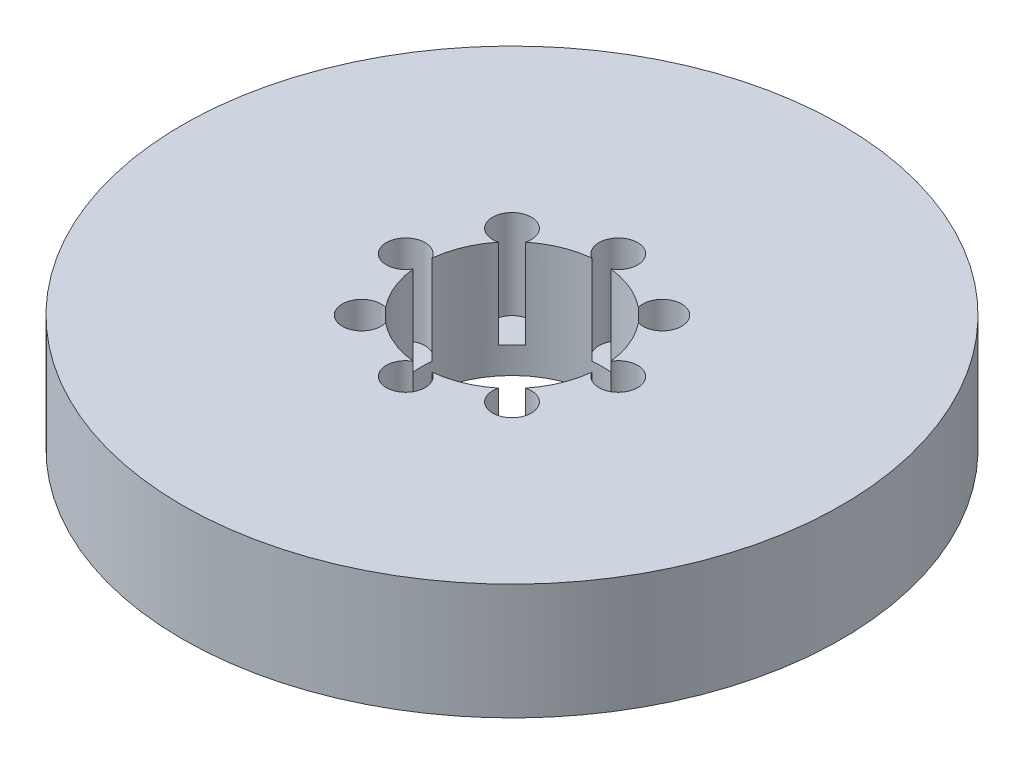
ISO-10303-21;
HEADER;
FILE_DESCRIPTION(('STEP AP214'),'2;1');
FILE_NAME('part.step','',(''),(''),'','','');
FILE_SCHEMA(('AUTOMOTIVE_DESIGN { 1 0 10303 214 1 1 1 1 }'));
ENDSEC;
DATA;
#1=APPLICATION_CONTEXT('core data for automotive mechanical design processes');
#2=APPLICATION_PROTOCOL_DEFINITION('international standard','automotive_design',2000,#1);
#3=PRODUCT_CONTEXT('',#1,'mechanical');
#4=PRODUCT('Part','Part','',(#3));
#5=PRODUCT_RELATED_PRODUCT_CATEGORY('part','',(#4));
#6=PRODUCT_DEFINITION_FORMATION('','',#4);
#7=PRODUCT_DEFINITION_CONTEXT('part definition',#1,'design');
#8=PRODUCT_DEFINITION('design','',#6,#7);
#9=PRODUCT_DEFINITION_SHAPE('','',#8);
#10=(LENGTH_UNIT() NAMED_UNIT(*) SI_UNIT(.MILLI.,.METRE.));
#11=(NAMED_UNIT(*) PLANE_ANGLE_UNIT() SI_UNIT($,.RADIAN.));
#12=(NAMED_UNIT(*) SI_UNIT($,.STERADIAN.) SOLID_ANGLE_UNIT());
#13=UNCERTAINTY_MEASURE_WITH_UNIT(LENGTH_MEASURE(1.E-05),#10,'distance_accuracy_value','');
#14=(GEOMETRIC_REPRESENTATION_CONTEXT(3) GLOBAL_UNCERTAINTY_ASSIGNED_CONTEXT((#13)) GLOBAL_UNIT_ASSIGNED_CONTEXT((#10,
#11,#12)) REPRESENTATION_CONTEXT('',''));
#15=CARTESIAN_POINT('',(0.,0.,0.));
#16=DIRECTION('',(0.,0.,1.));
#17=DIRECTION('',(1.,0.,0.));
#18=AXIS2_PLACEMENT_3D('',#15,#16,#17);
#19=CARTESIAN_POINT('',(0.,29.,0.));
#20=DIRECTION('',(0.,-1.,0.));
#21=DIRECTION('',(0.,0.,-1.));
#22=AXIS2_PLACEMENT_3D('',#19,#20,#21);
#23=CYLINDRICAL_SURFACE('',#22,82.5);
#24=CARTESIAN_POINT('',(0.,29.,0.));
#25=DIRECTION('',(0.,1.,0.));
#26=DIRECTION('',(0.,0.,1.));
#27=AXIS2_PLACEMENT_3D('',#24,#25,#26);
#28=CIRCLE('',#27,82.5);
#29=CARTESIAN_POINT('',(0.,29.,-82.5));
#30=VERTEX_POINT('',#29);
#31=EDGE_CURVE('E195',#30,#30,#28,.T.);
#32=CARTESIAN_POINT('',(0.,0.,0.));
#33=DIRECTION('',(0.,1.,0.));
#34=DIRECTION('',(0.,0.,1.));
#35=AXIS2_PLACEMENT_3D('',#32,#33,#34);
#36=CIRCLE('',#35,82.5);
#37=CARTESIAN_POINT('',(0.,0.,-82.5));
#38=VERTEX_POINT('',#37);
#39=EDGE_CURVE('E179',#38,#38,#36,.T.);
#40=CARTESIAN_POINT('',(0.,29.,-82.5));
#41=CARTESIAN_POINT('',(0.,28.6979166666667,-82.5));
#42=CARTESIAN_POINT('',(0.,28.3958333333333,-82.5));
#43=CARTESIAN_POINT('',(0.,27.7916666666667,-82.5));
#44=CARTESIAN_POINT('',(0.,27.4895833333333,-82.5));
#45=CARTESIAN_POINT('',(0.,26.8854166666667,-82.5));
#46=CARTESIAN_POINT('',(0.,26.5833333333333,-82.5));
#47=CARTESIAN_POINT('',(0.,25.9791666666667,-82.5));
#48=CARTESIAN_POINT('',(0.,25.6770833333333,-82.5));
#49=CARTESIAN_POINT('',(0.,25.0729166666667,-82.5));
#50=CARTESIAN_POINT('',(0.,24.7708333333333,-82.5));
#51=CARTESIAN_POINT('',(0.,24.1666666666667,-82.5));
#52=CARTESIAN_POINT('',(0.,23.8645833333333,-82.5));
#53=CARTESIAN_POINT('',(0.,23.2604166666667,-82.5));
#54=CARTESIAN_POINT('',(0.,22.9583333333333,-82.5));
#55=CARTESIAN_POINT('',(0.,22.3541666666667,-82.5));
#56=CARTESIAN_POINT('',(0.,22.0520833333333,-82.5));
#57=CARTESIAN_POINT('',(0.,21.4479166666667,-82.5));
#58=CARTESIAN_POINT('',(0.,21.1458333333333,-82.5));
#59=CARTESIAN_POINT('',(0.,20.5416666666667,-82.5));
#60=CARTESIAN_POINT('',(0.,20.2395833333333,-82.5));
#61=CARTESIAN_POINT('',(0.,19.6354166666667,-82.5));
#62=CARTESIAN_POINT('',(0.,19.3333333333333,-82.5));
#63=CARTESIAN_POINT('',(0.,18.7291666666667,-82.5));
#64=CARTESIAN_POINT('',(0.,18.4270833333333,-82.5));
#65=CARTESIAN_POINT('',(0.,17.8229166666667,-82.5));
#66=CARTESIAN_POINT('',(0.,17.5208333333333,-82.5));
#67=CARTESIAN_POINT('',(0.,16.9166666666667,-82.5));
#68=CARTESIAN_POINT('',(0.,16.6145833333333,-82.5));
#69=CARTESIAN_POINT('',(0.,16.0104166666667,-82.5));
#70=CARTESIAN_POINT('',(0.,15.7083333333333,-82.5));
#71=CARTESIAN_POINT('',(0.,15.1041666666667,-82.5));
#72=CARTESIAN_POINT('',(0.,14.8020833333333,-82.5));
#73=CARTESIAN_POINT('',(0.,14.1979166666667,-82.5));
#74=CARTESIAN_POINT('',(0.,13.8958333333333,-82.5));
#75=CARTESIAN_POINT('',(0.,13.2916666666667,-82.5));
#76=CARTESIAN_POINT('',(0.,12.9895833333333,-82.5));
#77=CARTESIAN_POINT('',(0.,12.3854166666667,-82.5));
#78=CARTESIAN_POINT('',(0.,12.0833333333333,-82.5));
#79=CARTESIAN_POINT('',(0.,11.4791666666667,-82.5));
#80=CARTESIAN_POINT('',(0.,11.1770833333333,-82.5));
#81=CARTESIAN_POINT('',(0.,10.5729166666667,-82.5));
#82=CARTESIAN_POINT('',(0.,10.2708333333333,-82.5));
#83=CARTESIAN_POINT('',(0.,9.66666666666667,-82.5));
#84=CARTESIAN_POINT('',(0.,9.36458333333333,-82.5));
#85=CARTESIAN_POINT('',(0.,8.76041666666667,-82.5));
#86=CARTESIAN_POINT('',(0.,8.45833333333333,-82.5));
#87=CARTESIAN_POINT('',(0.,7.85416666666667,-82.5));
#88=CARTESIAN_POINT('',(0.,7.55208333333333,-82.5));
#89=CARTESIAN_POINT('',(0.,6.94791666666667,-82.5));
#90=CARTESIAN_POINT('',(0.,6.64583333333333,-82.5));
#91=CARTESIAN_POINT('',(0.,6.04166666666667,-82.5));
#92=CARTESIAN_POINT('',(0.,5.73958333333333,-82.5));
#93=CARTESIAN_POINT('',(0.,5.13541666666667,-82.5));
#94=CARTESIAN_POINT('',(0.,4.83333333333333,-82.5));
#95=CARTESIAN_POINT('',(0.,4.22916666666667,-82.5));
#96=CARTESIAN_POINT('',(0.,3.92708333333333,-82.5));
#97=CARTESIAN_POINT('',(0.,3.32291666666667,-82.5));
#98=CARTESIAN_POINT('',(0.,3.02083333333333,-82.5));
#99=CARTESIAN_POINT('',(0.,2.41666666666667,-82.5));
#100=CARTESIAN_POINT('',(0.,2.11458333333333,-82.5));
#101=CARTESIAN_POINT('',(0.,1.51041666666667,-82.5));
#102=CARTESIAN_POINT('',(0.,1.20833333333333,-82.5));
#103=CARTESIAN_POINT('',(0.,0.604166666666667,-82.5));
#104=CARTESIAN_POINT('',(0.,0.302083333333333,-82.5));
#105=CARTESIAN_POINT('',(0.,0.,-82.5));
#106=B_SPLINE_CURVE_WITH_KNOTS('',3,(#40,#41,#42,#43,#44,#45,#46,#47,#48,#49,#50,#51,#52,#53,
#54,#55,#56,#57,#58,#59,#60,#61,#62,#63,#64,#65,#66,#67,#68,#69,#70,#71,#72,#73,#74,#75,#76,#77,
#78,#79,#80,#81,#82,#83,#84,#85,#86,#87,#88,#89,#90,#91,#92,#93,#94,#95,#96,#97,#98,#99,#100,
#101,#102,#103,#104,#105),.UNSPECIFIED.,.F.,.F.,(4,2,2,2,2,2,2,2,2,2,2,2,2,2,2,2,2,2,2,2,2,2,2,
2,2,2,2,2,2,2,2,2,4),(0.,0.906249999999997,1.8125,2.71875,3.625,4.53125,5.4375,6.34375,7.25,
8.15625,9.0625,9.96875,10.875,11.78125,12.6875,13.59375,14.5,15.40625,16.3125,17.21875,18.125,
19.03125,19.9375,20.84375,21.75,22.65625,23.5625,24.46875,25.375,26.28125,27.1875,28.09375,29.),.UNSPECIFIED.);
#107=EDGE_CURVE('BSEAM39',#30,#38,#106,.T.);
#108=ORIENTED_EDGE('',*,*,#31,.F.);
#109=ORIENTED_EDGE('',*,*,#39,.T.);
#110=ORIENTED_EDGE('',*,*,#107,.T.);
#111=ORIENTED_EDGE('',*,*,#107,.F.);
#112=EDGE_LOOP('',(#108,#110,#109,#111));
#113=FACE_BOUND('',#112,.T.);
#114=ADVANCED_FACE('F39',(#113),#23,.T.);
#115=CARTESIAN_POINT('',(0.,29.,0.));
#116=DIRECTION('',(0.,1.,0.));
#117=DIRECTION('',(0.,0.,1.));
#118=AXIS2_PLACEMENT_3D('',#115,#116,#117);
#119=PLANE('',#118);
#120=CARTESIAN_POINT('',(0.,29.,26.6063789040896));
#121=DIRECTION('',(0.,1.,0.));
#122=DIRECTION('',(1.,0.,0.));
#123=AXIS2_PLACEMENT_3D('',#120,#121,#122);
#124=CIRCLE('',#123,4.85010725986568);
#125=CARTESIAN_POINT('',(-2.37011530085525,29.,22.3748196296786));
#126=VERTEX_POINT('',#125);
#127=CARTESIAN_POINT('',(2.37011530085541,29.,22.3748196296786));
#128=VERTEX_POINT('',#127);
#129=EDGE_CURVE('E176',#126,#128,#124,.T.);
#130=ORIENTED_EDGE('',*,*,#129,.F.);
#131=CARTESIAN_POINT('',(0.,29.,0.));
#132=DIRECTION('',(0.,1.,0.));
#133=DIRECTION('',(0.,0.,1.));
#134=AXIS2_PLACEMENT_3D('',#131,#132,#133);
#135=CIRCLE('',#134,22.5);
#136=CARTESIAN_POINT('',(-14.1454620865428,29.,17.4973112894005));
#137=VERTEX_POINT('',#136);
#138=EDGE_CURVE('E166',#137,#126,#135,.T.);
#139=ORIENTED_EDGE('',*,*,#138,.F.);
#140=CARTESIAN_POINT('',(-18.8135509459004,29.,18.8135509459005));
#141=DIRECTION('',(0.,1.,0.));
#142=DIRECTION('',(0.707106781186549,0.,0.707106781186546));
#143=AXIS2_PLACEMENT_3D('',#140,#141,#142);
#144=CIRCLE('',#143,4.85010725986568);
#145=CARTESIAN_POINT('',(-17.4973112894004,29.,14.1454620865429));
#146=VERTEX_POINT('',#145);
#147=EDGE_CURVE('E147',#146,#137,#144,.T.);
#148=ORIENTED_EDGE('',*,*,#147,.F.);
#149=CARTESIAN_POINT('',(-22.3748196296786,29.,2.37011530085533));
#150=VERTEX_POINT('',#149);
#151=EDGE_CURVE('E180',#150,#146,#135,.T.);
#152=ORIENTED_EDGE('',*,*,#151,.F.);
#153=CARTESIAN_POINT('',(-26.6063789040896,29.,0.));
#154=DIRECTION('',(0.,1.,0.));
#155=DIRECTION('',(0.,0.,1.));
#156=AXIS2_PLACEMENT_3D('',#153,#154,#155);
#157=CIRCLE('',#156,4.85010725986568);
#158=CARTESIAN_POINT('',(-22.3748196296786,29.,-2.37011530085533));
#159=VERTEX_POINT('',#158);
#160=EDGE_CURVE('E186',#159,#150,#157,.T.);
#161=ORIENTED_EDGE('',*,*,#160,.F.);
#162=CARTESIAN_POINT('',(-17.4973112894006,29.,-14.1454620865426));
#163=VERTEX_POINT('',#162);
#164=EDGE_CURVE('E182',#163,#159,#135,.T.);
#165=ORIENTED_EDGE('',*,*,#164,.F.);
#166=CARTESIAN_POINT('',(-18.8135509459007,29.,-18.8135509459002));
#167=DIRECTION('',(0.,1.,0.));
#168=DIRECTION('',(-0.707106781186539,0.,0.707106781186556));
#169=AXIS2_PLACEMENT_3D('',#166,#167,#168);
#170=CIRCLE('',#169,4.85010725986568);
#171=CARTESIAN_POINT('',(-14.145462086543,29.,-17.4973112894003));
#172=VERTEX_POINT('',#171);
#173=EDGE_CURVE('E446',#172,#163,#170,.T.);
#174=ORIENTED_EDGE('',*,*,#173,.F.);
#175=CARTESIAN_POINT('',(-2.37011530085556,29.,-22.3748196296786));
#176=VERTEX_POINT('',#175);
#177=EDGE_CURVE('E452',#176,#172,#135,.T.);
#178=ORIENTED_EDGE('',*,*,#177,.F.);
#179=CARTESIAN_POINT('',(-2.78687026313455E-13,29.,-26.6063789040896));
#180=DIRECTION('',(0.,1.,0.));
#181=DIRECTION('',(-1.,0.,0.));
#182=AXIS2_PLACEMENT_3D('',#179,#180,#181);
#183=CIRCLE('',#182,4.85010725986568);
#184=CARTESIAN_POINT('',(2.3701153008551,29.,-22.3748196296786));
#185=VERTEX_POINT('',#184);
#186=EDGE_CURVE('E477',#185,#176,#183,.T.);
#187=ORIENTED_EDGE('',*,*,#186,.F.);
#188=CARTESIAN_POINT('',(14.1454620865427,29.,-17.4973112894005));
#189=VERTEX_POINT('',#188);
#190=EDGE_CURVE('E460',#189,#185,#135,.T.);
#191=ORIENTED_EDGE('',*,*,#190,.F.);
#192=CARTESIAN_POINT('',(18.8135509459003,29.,-18.8135509459006));
#193=DIRECTION('',(0.,1.,0.));
#194=DIRECTION('',(-0.707106781186554,0.,-0.707106781186541));
#195=AXIS2_PLACEMENT_3D('',#192,#193,#194);
#196=CIRCLE('',#195,4.85010725986568);
#197=CARTESIAN_POINT('',(17.4973112894003,29.,-14.145462086543));
#198=VERTEX_POINT('',#197);
#199=EDGE_CURVE('E464',#198,#189,#196,.T.);
#200=ORIENTED_EDGE('',*,*,#199,.F.);
#201=CARTESIAN_POINT('',(22.3748196296786,29.,-2.37011530085533));
#202=VERTEX_POINT('',#201);
#203=EDGE_CURVE('E459',#202,#198,#135,.T.);
#204=ORIENTED_EDGE('',*,*,#203,.F.);
#205=CARTESIAN_POINT('',(26.6063789040896,29.,0.));
#206=DIRECTION('',(0.,1.,0.));
#207=DIRECTION('',(0.,0.,-1.));
#208=AXIS2_PLACEMENT_3D('',#205,#206,#207);
#209=CIRCLE('',#208,4.85010725986568);
#210=CARTESIAN_POINT('',(22.3748196296786,29.,2.37011530085533));
#211=VERTEX_POINT('',#210);
#212=EDGE_CURVE('E469',#211,#202,#209,.T.);
#213=ORIENTED_EDGE('',*,*,#212,.F.);
#214=CARTESIAN_POINT('',(17.4973112894005,29.,14.1454620865427));
#215=VERTEX_POINT('',#214);
#216=EDGE_CURVE('E181',#215,#211,#135,.T.);
#217=ORIENTED_EDGE('',*,*,#216,.F.);
#218=CARTESIAN_POINT('',(18.8135509459005,29.,18.8135509459003));
#219=DIRECTION('',(0.,1.,0.));
#220=DIRECTION('',(0.707106781186544,0.,-0.707106781186551));
#221=AXIS2_PLACEMENT_3D('',#218,#219,#220);
#222=CIRCLE('',#221,4.85010725986568);
#223=CARTESIAN_POINT('',(14.1454620865429,29.,17.4973112894004));
#224=VERTEX_POINT('',#223);
#225=EDGE_CURVE('E475',#224,#215,#222,.T.);
#226=ORIENTED_EDGE('',*,*,#225,.F.);
#227=EDGE_CURVE('E177',#128,#224,#135,.T.);
#228=ORIENTED_EDGE('',*,*,#227,.F.);
#229=EDGE_LOOP('',(#130,#139,#148,#152,#161,#165,#174,#178,#187,#191,#200,#204,#213,#217,#226,#228));
#230=FACE_BOUND('',#229,.T.);
#231=ORIENTED_EDGE('',*,*,#31,.T.);
#232=EDGE_LOOP('',(#231));
#233=FACE_BOUND('',#232,.T.);
#234=ADVANCED_FACE('F172',(#230,#233),#119,.T.);
#235=CARTESIAN_POINT('',(0.,0.,0.));
#236=DIRECTION('',(0.,1.,0.));
#237=DIRECTION('',(0.,0.,1.));
#238=AXIS2_PLACEMENT_3D('',#235,#236,#237);
#239=PLANE('',#238);
#240=CARTESIAN_POINT('',(0.,0.,0.));
#241=DIRECTION('',(0.,1.,0.));
#242=DIRECTION('',(0.,0.,1.));
#243=AXIS2_PLACEMENT_3D('',#240,#241,#242);
#244=CIRCLE('',#243,22.5);
#245=CARTESIAN_POINT('',(0.,0.,22.5));
#246=VERTEX_POINT('',#245);
#247=EDGE_CURVE('E187',#246,#246,#244,.T.);
#248=ORIENTED_EDGE('',*,*,#247,.T.);
#249=EDGE_LOOP('',(#248));
#250=FACE_BOUND('',#249,.T.);
#251=ORIENTED_EDGE('',*,*,#39,.F.);
#252=EDGE_LOOP('',(#251));
#253=FACE_BOUND('',#252,.T.);
#254=ADVANCED_FACE('F270',(#250,#253),#239,.F.);
#255=CARTESIAN_POINT('',(0.,29.,0.));
#256=DIRECTION('',(0.,-1.,0.));
#257=DIRECTION('',(0.,0.,-1.));
#258=AXIS2_PLACEMENT_3D('',#255,#256,#257);
#259=CYLINDRICAL_SURFACE('',#258,22.5);
#260=DIRECTION('',(0.,1.,0.));
#261=VECTOR('',#260,1.);
#262=CARTESIAN_POINT('',(-2.37011530085523,17.8219842969985,22.3748196296786));
#263=LINE('',#262,#261);
#264=CARTESIAN_POINT('',(-2.37011530085525,6.64396859399703,22.3748196296786));
#265=VERTEX_POINT('',#264);
#266=EDGE_CURVE('E11',#265,#126,#263,.T.);
#267=ORIENTED_EDGE('',*,*,#266,.F.);
#268=CARTESIAN_POINT('',(0.,6.64396859399703,0.));
#269=DIRECTION('',(0.,1.,0.));
#270=DIRECTION('',(0.,0.,1.));
#271=AXIS2_PLACEMENT_3D('',#268,#269,#270);
#272=CIRCLE('',#271,22.5);
#273=CARTESIAN_POINT('',(2.37011530085541,6.64396859399703,22.3748196296786));
#274=VERTEX_POINT('',#273);
#275=EDGE_CURVE('E250',#265,#274,#272,.T.);
#276=ORIENTED_EDGE('',*,*,#275,.T.);
#277=DIRECTION('',(0.,1.,0.));
#278=VECTOR('',#277,1.);
#279=CARTESIAN_POINT('',(2.37011530085539,17.8219842969985,22.3748196296786));
#280=LINE('',#279,#278);
#281=EDGE_CURVE('E46',#128,#274,#280,.F.);
#282=ORIENTED_EDGE('',*,*,#281,.F.);
#283=ORIENTED_EDGE('',*,*,#227,.T.);
#284=DIRECTION('',(0.,1.,0.));
#285=VECTOR('',#284,1.);
#286=CARTESIAN_POINT('',(14.1454620865429,17.8219842969985,17.4973112894003));
#287=LINE('',#286,#285);
#288=CARTESIAN_POINT('',(14.1454620865429,6.64396859399703,17.4973112894004));
#289=VERTEX_POINT('',#288);
#290=EDGE_CURVE('E244',#289,#224,#287,.T.);
#291=ORIENTED_EDGE('',*,*,#290,.F.);
#292=CARTESIAN_POINT('',(0.,6.64396859399703,0.));
#293=DIRECTION('',(0.,1.,0.));
#294=DIRECTION('',(0.,0.,1.));
#295=AXIS2_PLACEMENT_3D('',#292,#293,#294);
#296=CIRCLE('',#295,22.5);
#297=CARTESIAN_POINT('',(17.4973112894005,6.64396859399703,14.1454620865427));
#298=VERTEX_POINT('',#297);
#299=EDGE_CURVE('E238',#289,#298,#296,.T.);
#300=ORIENTED_EDGE('',*,*,#299,.T.);
#301=DIRECTION('',(0.,1.,0.));
#302=VECTOR('',#301,1.);
#303=CARTESIAN_POINT('',(17.4973112894005,17.8219842969985,14.1454620865427));
#304=LINE('',#303,#302);
#305=EDGE_CURVE('E242',#215,#298,#304,.F.);
#306=ORIENTED_EDGE('',*,*,#305,.F.);
#307=ORIENTED_EDGE('',*,*,#216,.T.);
#308=DIRECTION('',(0.,1.,0.));
#309=VECTOR('',#308,1.);
#310=CARTESIAN_POINT('',(22.3748196296786,17.8219842969985,2.37011530085531));
#311=LINE('',#310,#309);
#312=CARTESIAN_POINT('',(22.3748196296786,6.64396859399703,2.37011530085533));
#313=VERTEX_POINT('',#312);
#314=EDGE_CURVE('E236',#313,#211,#311,.T.);
#315=ORIENTED_EDGE('',*,*,#314,.F.);
#316=CARTESIAN_POINT('',(0.,6.64396859399703,0.));
#317=DIRECTION('',(0.,1.,0.));
#318=DIRECTION('',(0.,0.,1.));
#319=AXIS2_PLACEMENT_3D('',#316,#317,#318);
#320=CIRCLE('',#319,22.5);
#321=CARTESIAN_POINT('',(22.3748196296786,6.64396859399703,-2.37011530085533));
#322=VERTEX_POINT('',#321);
#323=EDGE_CURVE('E235',#313,#322,#320,.T.);
#324=ORIENTED_EDGE('',*,*,#323,.T.);
#325=DIRECTION('',(0.,1.,0.));
#326=VECTOR('',#325,1.);
#327=CARTESIAN_POINT('',(22.3748196296786,17.8219842969985,-2.37011530085531));
#328=LINE('',#327,#326);
#329=EDGE_CURVE('E234',#202,#322,#328,.F.);
#330=ORIENTED_EDGE('',*,*,#329,.F.);
#331=ORIENTED_EDGE('',*,*,#203,.T.);
#332=DIRECTION('',(0.,1.,0.));
#333=VECTOR('',#332,1.);
#334=CARTESIAN_POINT('',(17.4973112894003,17.8219842969985,-14.145462086543));
#335=LINE('',#334,#333);
#336=CARTESIAN_POINT('',(17.4973112894003,6.64396859399703,-14.145462086543));
#337=VERTEX_POINT('',#336);
#338=EDGE_CURVE('E229',#337,#198,#335,.T.);
#339=ORIENTED_EDGE('',*,*,#338,.F.);
#340=CARTESIAN_POINT('',(0.,6.64396859399703,0.));
#341=DIRECTION('',(0.,1.,0.));
#342=DIRECTION('',(0.,0.,1.));
#343=AXIS2_PLACEMENT_3D('',#340,#341,#342);
#344=CIRCLE('',#343,22.5);
#345=CARTESIAN_POINT('',(14.1454620865427,6.64396859399703,-17.4973112894005));
#346=VERTEX_POINT('',#345);
#347=EDGE_CURVE('E221',#337,#346,#344,.T.);
#348=ORIENTED_EDGE('',*,*,#347,.T.);
#349=DIRECTION('',(0.,1.,0.));
#350=VECTOR('',#349,1.);
#351=CARTESIAN_POINT('',(14.1454620865427,17.8219842969985,-17.4973112894005));
#352=LINE('',#351,#350);
#353=EDGE_CURVE('E230',#189,#346,#352,.F.);
#354=ORIENTED_EDGE('',*,*,#353,.F.);
#355=ORIENTED_EDGE('',*,*,#190,.T.);
#356=DIRECTION('',(0.,1.,0.));
#357=VECTOR('',#356,1.);
#358=CARTESIAN_POINT('',(2.37011530085508,17.8219842969985,-22.3748196296786));
#359=LINE('',#358,#357);
#360=CARTESIAN_POINT('',(2.3701153008551,6.64396859399703,-22.3748196296786));
#361=VERTEX_POINT('',#360);
#362=EDGE_CURVE('E225',#361,#185,#359,.T.);
#363=ORIENTED_EDGE('',*,*,#362,.F.);
#364=CARTESIAN_POINT('',(0.,6.64396859399703,0.));
#365=DIRECTION('',(0.,1.,0.));
#366=DIRECTION('',(0.,0.,1.));
#367=AXIS2_PLACEMENT_3D('',#364,#365,#366);
#368=CIRCLE('',#367,22.5);
#369=CARTESIAN_POINT('',(-2.37011530085556,6.64396859399703,-22.3748196296786));
#370=VERTEX_POINT('',#369);
#371=EDGE_CURVE('E216',#361,#370,#368,.T.);
#372=ORIENTED_EDGE('',*,*,#371,.T.);
#373=DIRECTION('',(0.,1.,0.));
#374=VECTOR('',#373,1.);
#375=CARTESIAN_POINT('',(-2.37011530085554,17.8219842969985,-22.3748196296786));
#376=LINE('',#375,#374);
#377=EDGE_CURVE('E218',#176,#370,#376,.F.);
#378=ORIENTED_EDGE('',*,*,#377,.F.);
#379=ORIENTED_EDGE('',*,*,#177,.T.);
#380=DIRECTION('',(0.,1.,0.));
#381=VECTOR('',#380,1.);
#382=CARTESIAN_POINT('',(-14.145462086543,17.8219842969985,-17.4973112894002));
#383=LINE('',#382,#381);
#384=CARTESIAN_POINT('',(-14.145462086543,6.64396859399703,-17.4973112894003));
#385=VERTEX_POINT('',#384);
#386=EDGE_CURVE('E212',#385,#172,#383,.T.);
#387=ORIENTED_EDGE('',*,*,#386,.F.);
#388=CARTESIAN_POINT('',(0.,6.64396859399703,0.));
#389=DIRECTION('',(0.,1.,0.));
#390=DIRECTION('',(0.,0.,1.));
#391=AXIS2_PLACEMENT_3D('',#388,#389,#390);
#392=CIRCLE('',#391,22.5);
#393=CARTESIAN_POINT('',(-17.4973112894006,6.64396859399703,-14.1454620865426));
#394=VERTEX_POINT('',#393);
#395=EDGE_CURVE('E208',#385,#394,#392,.T.);
#396=ORIENTED_EDGE('',*,*,#395,.T.);
#397=DIRECTION('',(0.,1.,0.));
#398=VECTOR('',#397,1.);
#399=CARTESIAN_POINT('',(-17.4973112894006,17.8219842969985,-14.1454620865426));
#400=LINE('',#399,#398);
#401=EDGE_CURVE('E211',#163,#394,#400,.F.);
#402=ORIENTED_EDGE('',*,*,#401,.F.);
#403=ORIENTED_EDGE('',*,*,#164,.T.);
#404=DIRECTION('',(0.,1.,0.));
#405=VECTOR('',#404,1.);
#406=CARTESIAN_POINT('',(-22.3748196296786,17.8219842969985,-2.37011530085531));
#407=LINE('',#406,#405);
#408=CARTESIAN_POINT('',(-22.3748196296786,6.64396859399703,-2.37011530085533));
#409=VERTEX_POINT('',#408);
#410=EDGE_CURVE('E201',#409,#159,#407,.T.);
#411=ORIENTED_EDGE('',*,*,#410,.F.);
#412=CARTESIAN_POINT('',(0.,6.64396859399703,0.));
#413=DIRECTION('',(0.,1.,0.));
#414=DIRECTION('',(0.,0.,1.));
#415=AXIS2_PLACEMENT_3D('',#412,#413,#414);
#416=CIRCLE('',#415,22.5);
#417=CARTESIAN_POINT('',(-22.3748196296786,6.64396859399703,2.37011530085533));
#418=VERTEX_POINT('',#417);
#419=EDGE_CURVE('E194',#409,#418,#416,.T.);
#420=ORIENTED_EDGE('',*,*,#419,.T.);
#421=DIRECTION('',(0.,1.,0.));
#422=VECTOR('',#421,1.);
#423=CARTESIAN_POINT('',(-22.3748196296786,17.8219842969985,2.37011530085531));
#424=LINE('',#423,#422);
#425=EDGE_CURVE('E199',#150,#418,#424,.F.);
#426=ORIENTED_EDGE('',*,*,#425,.F.);
#427=ORIENTED_EDGE('',*,*,#151,.T.);
#428=DIRECTION('',(0.,1.,0.));
#429=VECTOR('',#428,1.);
#430=CARTESIAN_POINT('',(-17.4973112894004,17.8219842969985,14.1454620865429));
#431=LINE('',#430,#429);
#432=CARTESIAN_POINT('',(-17.4973112894004,6.64396859399703,14.1454620865429));
#433=VERTEX_POINT('',#432);
#434=EDGE_CURVE('E160',#433,#146,#431,.T.);
#435=ORIENTED_EDGE('',*,*,#434,.F.);
#436=CARTESIAN_POINT('',(0.,6.64396859399703,0.));
#437=DIRECTION('',(0.,1.,0.));
#438=DIRECTION('',(0.,0.,1.));
#439=AXIS2_PLACEMENT_3D('',#436,#437,#438);
#440=CIRCLE('',#439,22.5);
#441=CARTESIAN_POINT('',(-14.1454620865428,6.64396859399703,17.4973112894005));
#442=VERTEX_POINT('',#441);
#443=EDGE_CURVE('E168',#433,#442,#440,.T.);
#444=ORIENTED_EDGE('',*,*,#443,.T.);
#445=DIRECTION('',(0.,1.,0.));
#446=VECTOR('',#445,1.);
#447=CARTESIAN_POINT('',(-14.1454620865428,17.8219842969985,17.4973112894004));
#448=LINE('',#447,#446);
#449=EDGE_CURVE('E152',#137,#442,#448,.F.);
#450=ORIENTED_EDGE('',*,*,#449,.F.);
#451=ORIENTED_EDGE('',*,*,#138,.T.);
#452=EDGE_LOOP('',(#267,#276,#282,#283,#291,#300,#306,#307,#315,#324,#330,#331,#339,#348,#354,
#355,#363,#372,#378,#379,#387,#396,#402,#403,#411,#420,#426,#427,#435,#444,#450,#451));
#453=FACE_BOUND('',#452,.T.);
#454=ORIENTED_EDGE('',*,*,#247,.F.);
#455=EDGE_LOOP('',(#454));
#456=FACE_BOUND('',#455,.T.);
#457=ADVANCED_FACE('F170',(#453,#456),#259,.F.);
#458=CARTESIAN_POINT('',(-26.6063789040896,6.64396859399703,0.));
#459=DIRECTION('',(0.,1.,0.));
#460=DIRECTION('',(0.,0.,1.));
#461=AXIS2_PLACEMENT_3D('',#458,#459,#460);
#462=CYLINDRICAL_SURFACE('',#461,4.85010725986568);
#463=ORIENTED_EDGE('',*,*,#410,.T.);
#464=ORIENTED_EDGE('',*,*,#160,.T.);
#465=ORIENTED_EDGE('',*,*,#425,.T.);
#466=CARTESIAN_POINT('',(-26.6063789040896,6.64396859399703,0.));
#467=DIRECTION('',(0.,1.,0.));
#468=DIRECTION('',(0.,0.,1.));
#469=AXIS2_PLACEMENT_3D('',#466,#467,#468);
#470=CIRCLE('',#469,4.85010725986568);
#471=EDGE_CURVE('E191',#409,#418,#470,.T.);
#472=ORIENTED_EDGE('',*,*,#471,.F.);
#473=EDGE_LOOP('',(#463,#464,#465,#472));
#474=FACE_BOUND('',#473,.T.);
#475=ADVANCED_FACE('F279',(#474),#462,.F.);
#476=CARTESIAN_POINT('',(-26.6063789040896,6.64396859399703,0.));
#477=DIRECTION('',(0.,1.,0.));
#478=DIRECTION('',(0.,0.,1.));
#479=AXIS2_PLACEMENT_3D('',#476,#477,#478);
#480=PLANE('',#479);
#481=ORIENTED_EDGE('',*,*,#471,.T.);
#482=ORIENTED_EDGE('',*,*,#419,.F.);
#483=EDGE_LOOP('',(#481,#482));
#484=FACE_BOUND('',#483,.T.);
#485=ADVANCED_FACE('F285',(#484),#480,.T.);
#486=CARTESIAN_POINT('',(-18.8135509459004,6.64396859399703,18.8135509459005));
#487=DIRECTION('',(0.,1.,0.));
#488=DIRECTION('',(0.,0.,1.));
#489=AXIS2_PLACEMENT_3D('',#486,#487,#488);
#490=CYLINDRICAL_SURFACE('',#489,4.85010725986568);
#491=ORIENTED_EDGE('',*,*,#434,.T.);
#492=ORIENTED_EDGE('',*,*,#147,.T.);
#493=ORIENTED_EDGE('',*,*,#449,.T.);
#494=CARTESIAN_POINT('',(-18.8135509459004,6.64396859399703,18.8135509459005));
#495=DIRECTION('',(0.,1.,0.));
#496=DIRECTION('',(0.707106781186549,0.,0.707106781186546));
#497=AXIS2_PLACEMENT_3D('',#494,#495,#496);
#498=CIRCLE('',#497,4.85010725986568);
#499=EDGE_CURVE('E165',#433,#442,#498,.T.);
#500=ORIENTED_EDGE('',*,*,#499,.F.);
#501=EDGE_LOOP('',(#491,#492,#493,#500));
#502=FACE_BOUND('',#501,.T.);
#503=ADVANCED_FACE('F155',(#502),#490,.F.);
#504=CARTESIAN_POINT('',(-18.8135509459004,6.64396859399703,18.8135509459005));
#505=DIRECTION('',(0.,1.,0.));
#506=DIRECTION('',(0.707106781186549,0.,0.707106781186546));
#507=AXIS2_PLACEMENT_3D('',#504,#505,#506);
#508=PLANE('',#507);
#509=ORIENTED_EDGE('',*,*,#499,.T.);
#510=ORIENTED_EDGE('',*,*,#443,.F.);
#511=EDGE_LOOP('',(#509,#510));
#512=FACE_BOUND('',#511,.T.);
#513=ADVANCED_FACE('F288',(#512),#508,.T.);
#514=CARTESIAN_POINT('',(-18.8135509459007,6.64396859399703,-18.8135509459002));
#515=DIRECTION('',(0.,1.,0.));
#516=DIRECTION('',(0.,0.,1.));
#517=AXIS2_PLACEMENT_3D('',#514,#515,#516);
#518=CYLINDRICAL_SURFACE('',#517,4.85010725986568);
#519=ORIENTED_EDGE('',*,*,#386,.T.);
#520=ORIENTED_EDGE('',*,*,#173,.T.);
#521=ORIENTED_EDGE('',*,*,#401,.T.);
#522=CARTESIAN_POINT('',(-18.8135509459007,6.64396859399703,-18.8135509459002));
#523=DIRECTION('',(0.,1.,0.));
#524=DIRECTION('',(-0.707106781186539,0.,0.707106781186556));
#525=AXIS2_PLACEMENT_3D('',#522,#523,#524);
#526=CIRCLE('',#525,4.85010725986568);
#527=EDGE_CURVE('E447',#385,#394,#526,.T.);
#528=ORIENTED_EDGE('',*,*,#527,.F.);
#529=EDGE_LOOP('',(#519,#520,#521,#528));
#530=FACE_BOUND('',#529,.T.);
#531=ADVANCED_FACE('F295',(#530),#518,.F.);
#532=CARTESIAN_POINT('',(-18.8135509459007,6.64396859399703,-18.8135509459002));
#533=DIRECTION('',(0.,1.,0.));
#534=DIRECTION('',(-0.707106781186539,0.,0.707106781186556));
#535=AXIS2_PLACEMENT_3D('',#532,#533,#534);
#536=PLANE('',#535);
#537=ORIENTED_EDGE('',*,*,#527,.T.);
#538=ORIENTED_EDGE('',*,*,#395,.F.);
#539=EDGE_LOOP('',(#537,#538));
#540=FACE_BOUND('',#539,.T.);
#541=ADVANCED_FACE('F375',(#540),#536,.T.);
#542=CARTESIAN_POINT('',(-2.78687026313455E-13,6.64396859399703,-26.6063789040896));
#543=DIRECTION('',(0.,1.,0.));
#544=DIRECTION('',(0.,0.,1.));
#545=AXIS2_PLACEMENT_3D('',#542,#543,#544);
#546=CYLINDRICAL_SURFACE('',#545,4.85010725986568);
#547=ORIENTED_EDGE('',*,*,#362,.T.);
#548=ORIENTED_EDGE('',*,*,#186,.T.);
#549=ORIENTED_EDGE('',*,*,#377,.T.);
#550=CARTESIAN_POINT('',(-2.78687026313455E-13,6.64396859399703,-26.6063789040896));
#551=DIRECTION('',(0.,1.,0.));
#552=DIRECTION('',(-1.,0.,0.));
#553=AXIS2_PLACEMENT_3D('',#550,#551,#552);
#554=CIRCLE('',#553,4.85010725986568);
#555=EDGE_CURVE('E467',#361,#370,#554,.T.);
#556=ORIENTED_EDGE('',*,*,#555,.F.);
#557=EDGE_LOOP('',(#547,#548,#549,#556));
#558=FACE_BOUND('',#557,.T.);
#559=ADVANCED_FACE('F361',(#558),#546,.F.);
#560=CARTESIAN_POINT('',(-2.78687026313455E-13,6.64396859399703,-26.6063789040896));
#561=DIRECTION('',(0.,1.,0.));
#562=DIRECTION('',(-1.,0.,0.));
#563=AXIS2_PLACEMENT_3D('',#560,#561,#562);
#564=PLANE('',#563);
#565=ORIENTED_EDGE('',*,*,#555,.T.);
#566=ORIENTED_EDGE('',*,*,#371,.F.);
#567=EDGE_LOOP('',(#565,#566));
#568=FACE_BOUND('',#567,.T.);
#569=ADVANCED_FACE('F297',(#568),#564,.T.);
#570=CARTESIAN_POINT('',(18.8135509459003,6.64396859399703,-18.8135509459006));
#571=DIRECTION('',(0.,1.,0.));
#572=DIRECTION('',(0.,0.,1.));
#573=AXIS2_PLACEMENT_3D('',#570,#571,#572);
#574=CYLINDRICAL_SURFACE('',#573,4.85010725986568);
#575=ORIENTED_EDGE('',*,*,#338,.T.);
#576=ORIENTED_EDGE('',*,*,#199,.T.);
#577=ORIENTED_EDGE('',*,*,#353,.T.);
#578=CARTESIAN_POINT('',(18.8135509459003,6.64396859399703,-18.8135509459006));
#579=DIRECTION('',(0.,1.,0.));
#580=DIRECTION('',(-0.707106781186554,0.,-0.707106781186541));
#581=AXIS2_PLACEMENT_3D('',#578,#579,#580);
#582=CIRCLE('',#581,4.85010725986568);
#583=EDGE_CURVE('E470',#337,#346,#582,.T.);
#584=ORIENTED_EDGE('',*,*,#583,.F.);
#585=EDGE_LOOP('',(#575,#576,#577,#584));
#586=FACE_BOUND('',#585,.T.);
#587=ADVANCED_FACE('F294',(#586),#574,.F.);
#588=CARTESIAN_POINT('',(18.8135509459003,6.64396859399703,-18.8135509459006));
#589=DIRECTION('',(0.,1.,0.));
#590=DIRECTION('',(-0.707106781186554,0.,-0.707106781186541));
#591=AXIS2_PLACEMENT_3D('',#588,#589,#590);
#592=PLANE('',#591);
#593=ORIENTED_EDGE('',*,*,#583,.T.);
#594=ORIENTED_EDGE('',*,*,#347,.F.);
#595=EDGE_LOOP('',(#593,#594));
#596=FACE_BOUND('',#595,.T.);
#597=ADVANCED_FACE('F300',(#596),#592,.T.);
#598=CARTESIAN_POINT('',(26.6063789040896,6.64396859399703,0.));
#599=DIRECTION('',(0.,1.,0.));
#600=DIRECTION('',(0.,0.,1.));
#601=AXIS2_PLACEMENT_3D('',#598,#599,#600);
#602=CYLINDRICAL_SURFACE('',#601,4.85010725986568);
#603=ORIENTED_EDGE('',*,*,#314,.T.);
#604=ORIENTED_EDGE('',*,*,#212,.T.);
#605=ORIENTED_EDGE('',*,*,#329,.T.);
#606=CARTESIAN_POINT('',(26.6063789040896,6.64396859399703,0.));
#607=DIRECTION('',(0.,1.,0.));
#608=DIRECTION('',(0.,0.,-1.));
#609=AXIS2_PLACEMENT_3D('',#606,#607,#608);
#610=CIRCLE('',#609,4.85010725986568);
#611=EDGE_CURVE('E472',#313,#322,#610,.T.);
#612=ORIENTED_EDGE('',*,*,#611,.F.);
#613=EDGE_LOOP('',(#603,#604,#605,#612));
#614=FACE_BOUND('',#613,.T.);
#615=ADVANCED_FACE('F305',(#614),#602,.F.);
#616=CARTESIAN_POINT('',(26.6063789040896,6.64396859399703,0.));
#617=DIRECTION('',(0.,1.,0.));
#618=DIRECTION('',(0.,0.,-1.));
#619=AXIS2_PLACEMENT_3D('',#616,#617,#618);
#620=PLANE('',#619);
#621=ORIENTED_EDGE('',*,*,#611,.T.);
#622=ORIENTED_EDGE('',*,*,#323,.F.);
#623=EDGE_LOOP('',(#621,#622));
#624=FACE_BOUND('',#623,.T.);
#625=ADVANCED_FACE('F308',(#624),#620,.T.);
#626=CARTESIAN_POINT('',(18.8135509459005,6.64396859399703,18.8135509459003));
#627=DIRECTION('',(0.,1.,0.));
#628=DIRECTION('',(0.,0.,1.));
#629=AXIS2_PLACEMENT_3D('',#626,#627,#628);
#630=CYLINDRICAL_SURFACE('',#629,4.85010725986568);
#631=ORIENTED_EDGE('',*,*,#290,.T.);
#632=ORIENTED_EDGE('',*,*,#225,.T.);
#633=ORIENTED_EDGE('',*,*,#305,.T.);
#634=CARTESIAN_POINT('',(18.8135509459005,6.64396859399703,18.8135509459003));
#635=DIRECTION('',(0.,1.,0.));
#636=DIRECTION('',(0.707106781186544,0.,-0.707106781186551));
#637=AXIS2_PLACEMENT_3D('',#634,#635,#636);
#638=CIRCLE('',#637,4.85010725986568);
#639=EDGE_CURVE('E56',#289,#298,#638,.T.);
#640=ORIENTED_EDGE('',*,*,#639,.F.);
#641=EDGE_LOOP('',(#631,#632,#633,#640));
#642=FACE_BOUND('',#641,.T.);
#643=ADVANCED_FACE('F309',(#642),#630,.F.);
#644=CARTESIAN_POINT('',(18.8135509459005,6.64396859399703,18.8135509459003));
#645=DIRECTION('',(0.,1.,0.));
#646=DIRECTION('',(0.707106781186544,0.,-0.707106781186551));
#647=AXIS2_PLACEMENT_3D('',#644,#645,#646);
#648=PLANE('',#647);
#649=ORIENTED_EDGE('',*,*,#639,.T.);
#650=ORIENTED_EDGE('',*,*,#299,.F.);
#651=EDGE_LOOP('',(#649,#650));
#652=FACE_BOUND('',#651,.T.);
#653=ADVANCED_FACE('F256',(#652),#648,.T.);
#654=CARTESIAN_POINT('',(0.,6.64396859399703,26.6063789040896));
#655=DIRECTION('',(0.,1.,0.));
#656=DIRECTION('',(0.,0.,1.));
#657=AXIS2_PLACEMENT_3D('',#654,#655,#656);
#658=CYLINDRICAL_SURFACE('',#657,4.85010725986568);
#659=ORIENTED_EDGE('',*,*,#266,.T.);
#660=ORIENTED_EDGE('',*,*,#129,.T.);
#661=ORIENTED_EDGE('',*,*,#281,.T.);
#662=CARTESIAN_POINT('',(0.,6.64396859399703,26.6063789040896));
#663=DIRECTION('',(0.,1.,0.));
#664=DIRECTION('',(1.,0.,0.));
#665=AXIS2_PLACEMENT_3D('',#662,#663,#664);
#666=CIRCLE('',#665,4.85010725986568);
#667=EDGE_CURVE('E55',#265,#274,#666,.T.);
#668=ORIENTED_EDGE('',*,*,#667,.F.);
#669=EDGE_LOOP('',(#659,#660,#661,#668));
#670=FACE_BOUND('',#669,.T.);
#671=ADVANCED_FACE('F253',(#670),#658,.F.);
#672=CARTESIAN_POINT('',(0.,6.64396859399703,26.6063789040896));
#673=DIRECTION('',(0.,1.,0.));
#674=DIRECTION('',(1.,0.,0.));
#675=AXIS2_PLACEMENT_3D('',#672,#673,#674);
#676=PLANE('',#675);
#677=ORIENTED_EDGE('',*,*,#667,.T.);
#678=ORIENTED_EDGE('',*,*,#275,.F.);
#679=EDGE_LOOP('',(#677,#678));
#680=FACE_BOUND('',#679,.T.);
#681=ADVANCED_FACE('F252',(#680),#676,.T.);
#682=CLOSED_SHELL('',(#114,#234,#254,#457,#475,#485,#503,#513,#531,#541,#559,#569,#587,#597,
#615,#625,#643,#653,#671,#681));
#683=MANIFOLD_SOLID_BREP('B2',#682);
#684=ADVANCED_BREP_SHAPE_REPRESENTATION('',(#18,#683),#14);
#685=SHAPE_DEFINITION_REPRESENTATION(#9,#684);
ENDSEC;
END-ISO-10303-21;
